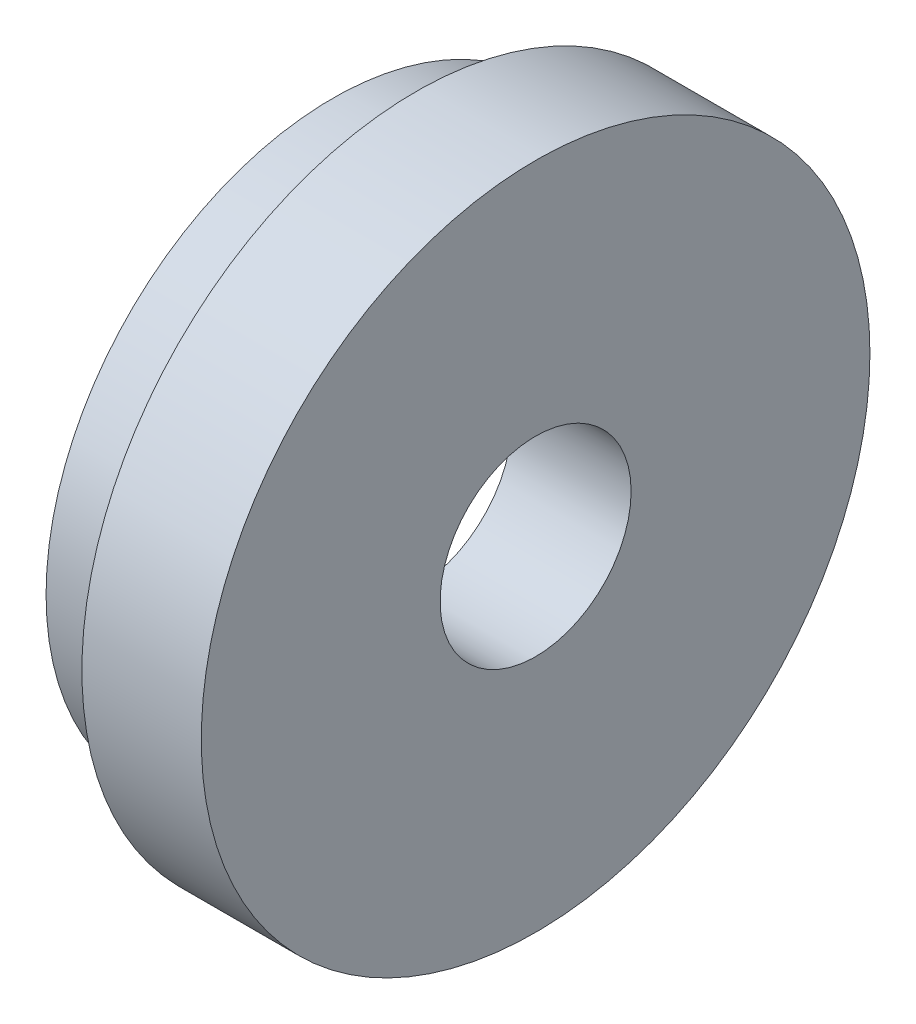
ISO-10303-21;
HEADER;
FILE_DESCRIPTION(('STEP AP214'),'2;1');
FILE_NAME('part.step','',(''),(''),'','','');
FILE_SCHEMA(('AUTOMOTIVE_DESIGN { 1 0 10303 214 1 1 1 1 }'));
ENDSEC;
DATA;
#1=APPLICATION_CONTEXT('core data for automotive mechanical design processes');
#2=APPLICATION_PROTOCOL_DEFINITION('international standard','automotive_design',2000,#1);
#3=PRODUCT_CONTEXT('',#1,'mechanical');
#4=PRODUCT('Part','Part','',(#3));
#5=PRODUCT_RELATED_PRODUCT_CATEGORY('part','',(#4));
#6=PRODUCT_DEFINITION_FORMATION('','',#4);
#7=PRODUCT_DEFINITION_CONTEXT('part definition',#1,'design');
#8=PRODUCT_DEFINITION('design','',#6,#7);
#9=PRODUCT_DEFINITION_SHAPE('','',#8);
#10=(LENGTH_UNIT() NAMED_UNIT(*) SI_UNIT(.MILLI.,.METRE.));
#11=(NAMED_UNIT(*) PLANE_ANGLE_UNIT() SI_UNIT($,.RADIAN.));
#12=(NAMED_UNIT(*) SI_UNIT($,.STERADIAN.) SOLID_ANGLE_UNIT());
#13=UNCERTAINTY_MEASURE_WITH_UNIT(LENGTH_MEASURE(1.E-05),#10,'distance_accuracy_value','');
#14=(GEOMETRIC_REPRESENTATION_CONTEXT(3) GLOBAL_UNCERTAINTY_ASSIGNED_CONTEXT((#13)) GLOBAL_UNIT_ASSIGNED_CONTEXT((#10,
#11,#12)) REPRESENTATION_CONTEXT('',''));
#15=CARTESIAN_POINT('',(0.,0.,0.));
#16=DIRECTION('',(0.,0.,1.));
#17=DIRECTION('',(1.,0.,0.));
#18=AXIS2_PLACEMENT_3D('',#15,#16,#17);
#19=CARTESIAN_POINT('',(0.,0.,0.));
#20=DIRECTION('',(1.,0.,0.));
#21=DIRECTION('',(0.,0.,-1.));
#22=AXIS2_PLACEMENT_3D('',#19,#20,#21);
#23=PLANE('',#22);
#24=CARTESIAN_POINT('',(0.,0.,0.));
#25=DIRECTION('',(1.,0.,0.));
#26=DIRECTION('',(0.,0.,-1.));
#27=AXIS2_PLACEMENT_3D('',#24,#25,#26);
#28=CIRCLE('',#27,4.);
#29=CARTESIAN_POINT('',(0.,0.,-4.));
#30=VERTEX_POINT('',#29);
#31=EDGE_CURVE('E48',#30,#30,#28,.T.);
#32=ORIENTED_EDGE('',*,*,#31,.T.);
#33=EDGE_LOOP('',(#32));
#34=FACE_BOUND('',#33,.T.);
#35=CARTESIAN_POINT('',(0.,0.,0.));
#36=DIRECTION('',(-1.,0.,0.));
#37=DIRECTION('',(0.,0.,1.));
#38=AXIS2_PLACEMENT_3D('',#35,#36,#37);
#39=CIRCLE('',#38,11.);
#40=CARTESIAN_POINT('',(0.,0.,11.));
#41=VERTEX_POINT('',#40);
#42=EDGE_CURVE('E57',#41,#41,#39,.T.);
#43=ORIENTED_EDGE('',*,*,#42,.T.);
#44=EDGE_LOOP('',(#43));
#45=FACE_BOUND('',#44,.T.);
#46=ADVANCED_FACE('F30',(#34,#45),#23,.F.);
#47=CARTESIAN_POINT('',(5.,0.,0.));
#48=DIRECTION('',(1.,0.,0.));
#49=DIRECTION('',(0.,0.,-1.));
#50=AXIS2_PLACEMENT_3D('',#47,#48,#49);
#51=PLANE('',#50);
#52=CARTESIAN_POINT('',(5.,0.,0.));
#53=DIRECTION('',(1.,0.,0.));
#54=DIRECTION('',(0.,0.,-1.));
#55=AXIS2_PLACEMENT_3D('',#52,#53,#54);
#56=CIRCLE('',#55,14.);
#57=CARTESIAN_POINT('',(5.,0.,-14.));
#58=VERTEX_POINT('',#57);
#59=EDGE_CURVE('E37',#58,#58,#56,.T.);
#60=ORIENTED_EDGE('',*,*,#59,.T.);
#61=EDGE_LOOP('',(#60));
#62=FACE_BOUND('',#61,.T.);
#63=CARTESIAN_POINT('',(5.,0.,0.));
#64=DIRECTION('',(1.,0.,0.));
#65=DIRECTION('',(0.,0.,-1.));
#66=AXIS2_PLACEMENT_3D('',#63,#64,#65);
#67=CIRCLE('',#66,4.);
#68=CARTESIAN_POINT('',(5.,0.,-4.));
#69=VERTEX_POINT('',#68);
#70=EDGE_CURVE('E46',#69,#69,#67,.T.);
#71=ORIENTED_EDGE('',*,*,#70,.F.);
#72=EDGE_LOOP('',(#71));
#73=FACE_BOUND('',#72,.T.);
#74=ADVANCED_FACE('F82',(#62,#73),#51,.T.);
#75=CARTESIAN_POINT('',(0.,0.,0.));
#76=DIRECTION('',(1.,0.,0.));
#77=DIRECTION('',(0.,0.,-1.));
#78=AXIS2_PLACEMENT_3D('',#75,#76,#77);
#79=CIRCLE('',#78,12.);
#80=CARTESIAN_POINT('',(0.,0.,-12.));
#81=VERTEX_POINT('',#80);
#82=EDGE_CURVE('E10',#81,#81,#79,.F.);
#83=ORIENTED_EDGE('',*,*,#82,.F.);
#84=EDGE_LOOP('',(#83));
#85=FACE_BOUND('',#84,.T.);
#86=CARTESIAN_POINT('',(0.,0.,0.));
#87=DIRECTION('',(1.,0.,0.));
#88=DIRECTION('',(0.,0.,-1.));
#89=AXIS2_PLACEMENT_3D('',#86,#87,#88);
#90=CIRCLE('',#89,14.);
#91=CARTESIAN_POINT('',(0.,0.,-14.));
#92=VERTEX_POINT('',#91);
#93=EDGE_CURVE('E41',#92,#92,#90,.T.);
#94=ORIENTED_EDGE('',*,*,#93,.F.);
#95=EDGE_LOOP('',(#94));
#96=FACE_BOUND('',#95,.T.);
#97=ADVANCED_FACE('F84',(#85,#96),#23,.F.);
#98=CARTESIAN_POINT('',(5.,0.,0.));
#99=DIRECTION('',(-1.,0.,0.));
#100=DIRECTION('',(0.,0.,1.));
#101=AXIS2_PLACEMENT_3D('',#98,#99,#100);
#102=CYLINDRICAL_SURFACE('',#101,14.);
#103=ORIENTED_EDGE('',*,*,#59,.F.);
#104=EDGE_LOOP('',(#103));
#105=FACE_BOUND('',#104,.T.);
#106=ORIENTED_EDGE('',*,*,#93,.T.);
#107=EDGE_LOOP('',(#106));
#108=FACE_BOUND('',#107,.T.);
#109=ADVANCED_FACE('F32',(#105,#108),#102,.T.);
#110=CARTESIAN_POINT('',(5.,0.,0.));
#111=DIRECTION('',(-1.,0.,0.));
#112=DIRECTION('',(0.,0.,1.));
#113=AXIS2_PLACEMENT_3D('',#110,#111,#112);
#114=CYLINDRICAL_SURFACE('',#113,4.);
#115=ORIENTED_EDGE('',*,*,#70,.T.);
#116=EDGE_LOOP('',(#115));
#117=FACE_BOUND('',#116,.T.);
#118=ORIENTED_EDGE('',*,*,#31,.F.);
#119=EDGE_LOOP('',(#118));
#120=FACE_BOUND('',#119,.T.);
#121=ADVANCED_FACE('F69',(#117,#120),#114,.F.);
#122=CARTESIAN_POINT('',(-3.5,0.,0.));
#123=DIRECTION('',(-1.,0.,0.));
#124=DIRECTION('',(0.,0.,1.));
#125=AXIS2_PLACEMENT_3D('',#122,#123,#124);
#126=PLANE('',#125);
#127=CARTESIAN_POINT('',(-3.5,0.,0.));
#128=DIRECTION('',(-1.,0.,0.));
#129=DIRECTION('',(0.,0.,1.));
#130=AXIS2_PLACEMENT_3D('',#127,#128,#129);
#131=CIRCLE('',#130,12.);
#132=CARTESIAN_POINT('',(-3.5,0.,12.));
#133=VERTEX_POINT('',#132);
#134=EDGE_CURVE('E51',#133,#133,#131,.T.);
#135=ORIENTED_EDGE('',*,*,#134,.T.);
#136=EDGE_LOOP('',(#135));
#137=FACE_BOUND('',#136,.T.);
#138=CARTESIAN_POINT('',(-3.5,0.,0.));
#139=DIRECTION('',(-1.,0.,0.));
#140=DIRECTION('',(0.,0.,1.));
#141=AXIS2_PLACEMENT_3D('',#138,#139,#140);
#142=CIRCLE('',#141,11.);
#143=CARTESIAN_POINT('',(-3.5,0.,11.));
#144=VERTEX_POINT('',#143);
#145=EDGE_CURVE('E56',#144,#144,#142,.T.);
#146=ORIENTED_EDGE('',*,*,#145,.F.);
#147=EDGE_LOOP('',(#146));
#148=FACE_BOUND('',#147,.T.);
#149=ADVANCED_FACE('F66',(#137,#148),#126,.T.);
#150=CARTESIAN_POINT('',(-3.5,0.,0.));
#151=DIRECTION('',(1.,0.,0.));
#152=DIRECTION('',(0.,0.,-1.));
#153=AXIS2_PLACEMENT_3D('',#150,#151,#152);
#154=CYLINDRICAL_SURFACE('',#153,12.);
#155=ORIENTED_EDGE('',*,*,#134,.F.);
#156=EDGE_LOOP('',(#155));
#157=FACE_BOUND('',#156,.T.);
#158=ORIENTED_EDGE('',*,*,#82,.T.);
#159=EDGE_LOOP('',(#158));
#160=FACE_BOUND('',#159,.T.);
#161=ADVANCED_FACE('F68',(#157,#160),#154,.T.);
#162=CARTESIAN_POINT('',(-3.5,0.,0.));
#163=DIRECTION('',(1.,0.,0.));
#164=DIRECTION('',(0.,0.,-1.));
#165=AXIS2_PLACEMENT_3D('',#162,#163,#164);
#166=CYLINDRICAL_SURFACE('',#165,11.);
#167=ORIENTED_EDGE('',*,*,#145,.T.);
#168=EDGE_LOOP('',(#167));
#169=FACE_BOUND('',#168,.T.);
#170=ORIENTED_EDGE('',*,*,#42,.F.);
#171=EDGE_LOOP('',(#170));
#172=FACE_BOUND('',#171,.T.);
#173=ADVANCED_FACE('F63',(#169,#172),#166,.F.);
#174=CLOSED_SHELL('',(#46,#74,#97,#109,#121,#149,#161,#173));
#175=MANIFOLD_SOLID_BREP('B2',#174);
#176=ADVANCED_BREP_SHAPE_REPRESENTATION('',(#18,#175),#14);
#177=SHAPE_DEFINITION_REPRESENTATION(#9,#176);
ENDSEC;
END-ISO-10303-21;
